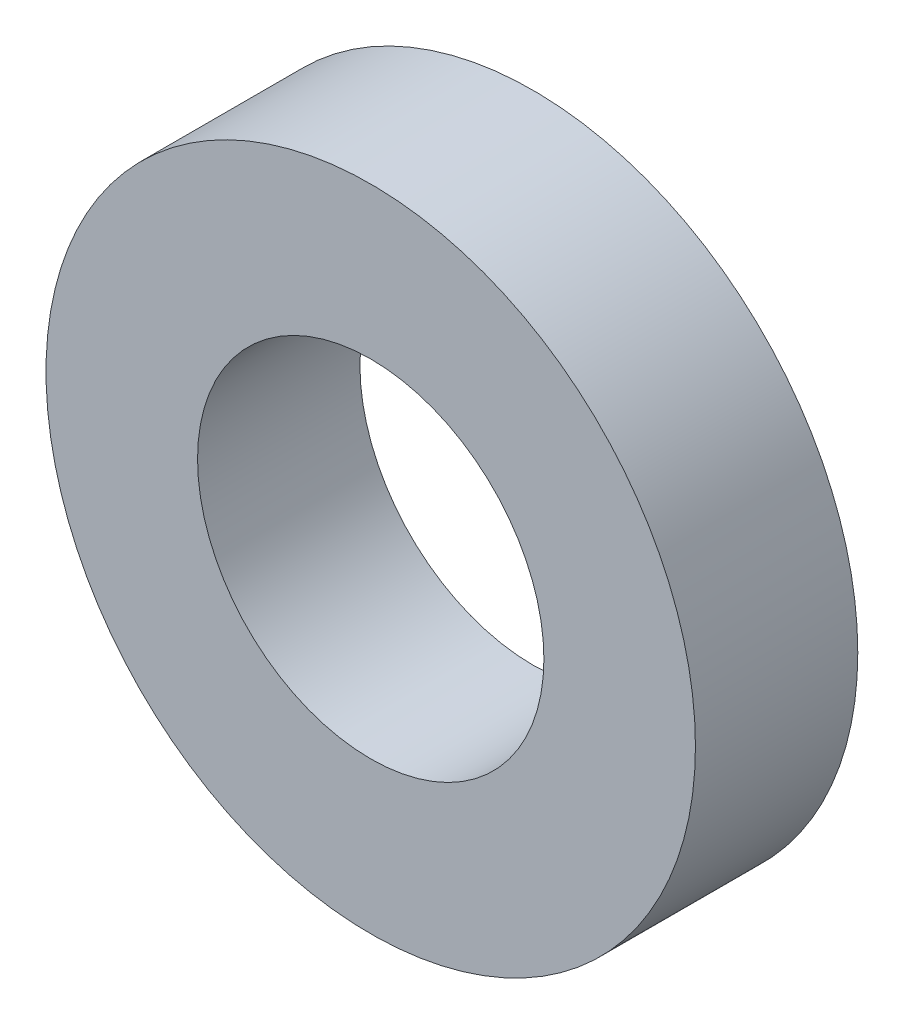
ISO-10303-21;
HEADER;
FILE_DESCRIPTION(('STEP AP214'),'2;1');
FILE_NAME('part.step','',(''),(''),'','','');
FILE_SCHEMA(('AUTOMOTIVE_DESIGN { 1 0 10303 214 1 1 1 1 }'));
ENDSEC;
DATA;
#1=APPLICATION_CONTEXT('core data for automotive mechanical design processes');
#2=APPLICATION_PROTOCOL_DEFINITION('international standard','automotive_design',2000,#1);
#3=PRODUCT_CONTEXT('',#1,'mechanical');
#4=PRODUCT('Part','Part','',(#3));
#5=PRODUCT_RELATED_PRODUCT_CATEGORY('part','',(#4));
#6=PRODUCT_DEFINITION_FORMATION('','',#4);
#7=PRODUCT_DEFINITION_CONTEXT('part definition',#1,'design');
#8=PRODUCT_DEFINITION('design','',#6,#7);
#9=PRODUCT_DEFINITION_SHAPE('','',#8);
#10=(LENGTH_UNIT() NAMED_UNIT(*) SI_UNIT(.MILLI.,.METRE.));
#11=(NAMED_UNIT(*) PLANE_ANGLE_UNIT() SI_UNIT($,.RADIAN.));
#12=(NAMED_UNIT(*) SI_UNIT($,.STERADIAN.) SOLID_ANGLE_UNIT());
#13=UNCERTAINTY_MEASURE_WITH_UNIT(LENGTH_MEASURE(1.E-05),#10,'distance_accuracy_value','');
#14=(GEOMETRIC_REPRESENTATION_CONTEXT(3) GLOBAL_UNCERTAINTY_ASSIGNED_CONTEXT((#13)) GLOBAL_UNIT_ASSIGNED_CONTEXT((#10,
#11,#12)) REPRESENTATION_CONTEXT('',''));
#15=CARTESIAN_POINT('',(0.,0.,0.));
#16=DIRECTION('',(0.,0.,1.));
#17=DIRECTION('',(1.,0.,0.));
#18=AXIS2_PLACEMENT_3D('',#15,#16,#17);
#19=CARTESIAN_POINT('',(0.,0.,1.5));
#20=DIRECTION('',(0.,0.,1.));
#21=DIRECTION('',(1.,0.,0.));
#22=AXIS2_PLACEMENT_3D('',#19,#20,#21);
#23=PLANE('',#22);
#24=CARTESIAN_POINT('',(0.,0.,1.5));
#25=DIRECTION('',(0.,0.,1.));
#26=DIRECTION('',(1.,0.,0.));
#27=AXIS2_PLACEMENT_3D('',#24,#25,#26);
#28=CIRCLE('',#27,3.);
#29=CARTESIAN_POINT('',(3.,0.,1.5));
#30=VERTEX_POINT('',#29);
#31=EDGE_CURVE('E10',#30,#30,#28,.T.);
#32=ORIENTED_EDGE('',*,*,#31,.T.);
#33=EDGE_LOOP('',(#32));
#34=FACE_BOUND('',#33,.T.);
#35=CARTESIAN_POINT('',(0.,0.,1.5));
#36=DIRECTION('',(0.,0.,1.));
#37=DIRECTION('',(1.,0.,0.));
#38=AXIS2_PLACEMENT_3D('',#35,#36,#37);
#39=CIRCLE('',#38,1.6);
#40=CARTESIAN_POINT('',(1.6,0.,1.5));
#41=VERTEX_POINT('',#40);
#42=EDGE_CURVE('E58',#41,#41,#39,.T.);
#43=ORIENTED_EDGE('',*,*,#42,.F.);
#44=EDGE_LOOP('',(#43));
#45=FACE_BOUND('',#44,.T.);
#46=ADVANCED_FACE('F43',(#34,#45),#23,.T.);
#47=CARTESIAN_POINT('',(0.,0.,0.));
#48=DIRECTION('',(0.,0.,1.));
#49=DIRECTION('',(1.,0.,0.));
#50=AXIS2_PLACEMENT_3D('',#47,#48,#49);
#51=PLANE('',#50);
#52=CARTESIAN_POINT('',(0.,0.,0.));
#53=DIRECTION('',(0.,0.,1.));
#54=DIRECTION('',(1.,0.,0.));
#55=AXIS2_PLACEMENT_3D('',#52,#53,#54);
#56=CIRCLE('',#55,3.);
#57=CARTESIAN_POINT('',(3.,0.,0.));
#58=VERTEX_POINT('',#57);
#59=EDGE_CURVE('E47',#58,#58,#56,.T.);
#60=ORIENTED_EDGE('',*,*,#59,.F.);
#61=EDGE_LOOP('',(#60));
#62=FACE_BOUND('',#61,.T.);
#63=CARTESIAN_POINT('',(0.,0.,0.));
#64=DIRECTION('',(0.,0.,1.));
#65=DIRECTION('',(1.,0.,0.));
#66=AXIS2_PLACEMENT_3D('',#63,#64,#65);
#67=CIRCLE('',#66,1.6);
#68=CARTESIAN_POINT('',(1.6,0.,0.));
#69=VERTEX_POINT('',#68);
#70=EDGE_CURVE('E60',#69,#69,#67,.T.);
#71=ORIENTED_EDGE('',*,*,#70,.T.);
#72=EDGE_LOOP('',(#71));
#73=FACE_BOUND('',#72,.T.);
#74=ADVANCED_FACE('F70',(#62,#73),#51,.F.);
#75=CARTESIAN_POINT('',(0.,0.,1.5));
#76=DIRECTION('',(0.,0.,-1.));
#77=DIRECTION('',(-1.,0.,0.));
#78=AXIS2_PLACEMENT_3D('',#75,#76,#77);
#79=CYLINDRICAL_SURFACE('',#78,3.);
#80=ORIENTED_EDGE('',*,*,#31,.F.);
#81=EDGE_LOOP('',(#80));
#82=FACE_BOUND('',#81,.T.);
#83=ORIENTED_EDGE('',*,*,#59,.T.);
#84=EDGE_LOOP('',(#83));
#85=FACE_BOUND('',#84,.T.);
#86=ADVANCED_FACE('F45',(#82,#85),#79,.T.);
#87=CARTESIAN_POINT('',(0.,0.,1.5));
#88=DIRECTION('',(0.,0.,-1.));
#89=DIRECTION('',(-1.,0.,0.));
#90=AXIS2_PLACEMENT_3D('',#87,#88,#89);
#91=CYLINDRICAL_SURFACE('',#90,1.6);
#92=ORIENTED_EDGE('',*,*,#42,.T.);
#93=EDGE_LOOP('',(#92));
#94=FACE_BOUND('',#93,.T.);
#95=ORIENTED_EDGE('',*,*,#70,.F.);
#96=EDGE_LOOP('',(#95));
#97=FACE_BOUND('',#96,.T.);
#98=ADVANCED_FACE('F66',(#94,#97),#91,.F.);
#99=CLOSED_SHELL('',(#46,#74,#86,#98));
#100=MANIFOLD_SOLID_BREP('B2',#99);
#101=ADVANCED_BREP_SHAPE_REPRESENTATION('',(#18,#100),#14);
#102=SHAPE_DEFINITION_REPRESENTATION(#9,#101);
ENDSEC;
END-ISO-10303-21;
